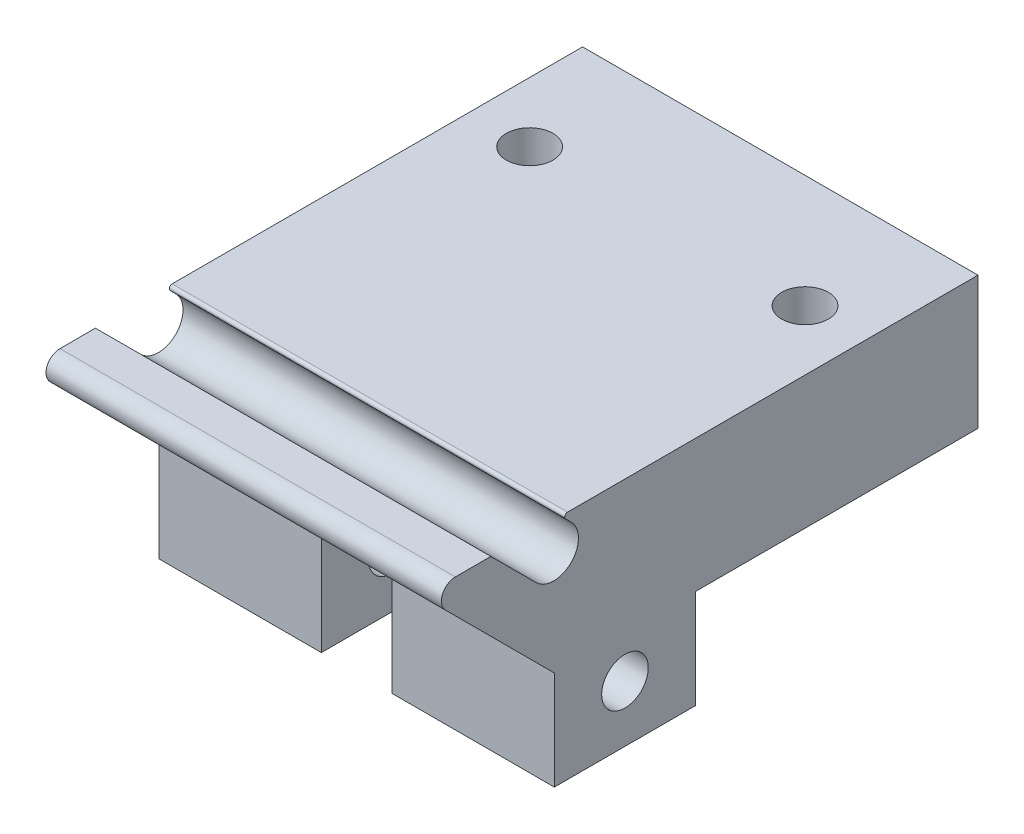
ISO-10303-21;
HEADER;
FILE_DESCRIPTION(('STEP AP214'),'2;1');
FILE_NAME('part.step','',(''),(''),'','','');
FILE_SCHEMA(('AUTOMOTIVE_DESIGN { 1 0 10303 214 1 1 1 1 }'));
ENDSEC;
DATA;
#1=APPLICATION_CONTEXT('core data for automotive mechanical design processes');
#2=APPLICATION_PROTOCOL_DEFINITION('international standard','automotive_design',2000,#1);
#3=PRODUCT_CONTEXT('',#1,'mechanical');
#4=PRODUCT('Part','Part','',(#3));
#5=PRODUCT_RELATED_PRODUCT_CATEGORY('part','',(#4));
#6=PRODUCT_DEFINITION_FORMATION('','',#4);
#7=PRODUCT_DEFINITION_CONTEXT('part definition',#1,'design');
#8=PRODUCT_DEFINITION('design','',#6,#7);
#9=PRODUCT_DEFINITION_SHAPE('','',#8);
#10=(LENGTH_UNIT() NAMED_UNIT(*) SI_UNIT(.MILLI.,.METRE.));
#11=(NAMED_UNIT(*) PLANE_ANGLE_UNIT() SI_UNIT($,.RADIAN.));
#12=(NAMED_UNIT(*) SI_UNIT($,.STERADIAN.) SOLID_ANGLE_UNIT());
#13=UNCERTAINTY_MEASURE_WITH_UNIT(LENGTH_MEASURE(1.E-05),#10,'distance_accuracy_value','');
#14=(GEOMETRIC_REPRESENTATION_CONTEXT(3) GLOBAL_UNCERTAINTY_ASSIGNED_CONTEXT((#13)) GLOBAL_UNIT_ASSIGNED_CONTEXT((#10,
#11,#12)) REPRESENTATION_CONTEXT('',''));
#15=CARTESIAN_POINT('',(0.,0.,0.));
#16=DIRECTION('',(0.,0.,1.));
#17=DIRECTION('',(1.,0.,0.));
#18=AXIS2_PLACEMENT_3D('',#15,#16,#17);
#19=CARTESIAN_POINT('',(-14.,3.7104647199012,37.0114647199012));
#20=DIRECTION('',(-1.,0.,0.));
#21=DIRECTION('',(0.,-1.,0.));
#22=AXIS2_PLACEMENT_3D('',#19,#20,#21);
#23=CYLINDRICAL_SURFACE('',#22,0.988535280098797);
#24=DIRECTION('',(1.,0.,0.));
#25=VECTOR('',#24,1.);
#26=CARTESIAN_POINT('',(-14.,4.699,37.0114647199012));
#27=LINE('',#26,#25);
#28=CARTESIAN_POINT('',(-14.,4.699,37.0114647199012));
#29=VERTEX_POINT('',#28);
#30=CARTESIAN_POINT('',(14.,4.699,37.0114647199012));
#31=VERTEX_POINT('',#30);
#32=EDGE_CURVE('E219',#29,#31,#27,.T.);
#33=ORIENTED_EDGE('',*,*,#32,.F.);
#34=CARTESIAN_POINT('',(-14.,3.7104647199012,37.0114647199012));
#35=DIRECTION('',(1.,0.,0.));
#36=DIRECTION('',(0.,0.,-1.));
#37=AXIS2_PLACEMENT_3D('',#34,#35,#36);
#38=CIRCLE('',#37,0.988535280098797);
#39=CARTESIAN_POINT('',(-14.,3.0114647199012,37.7104647199012));
#40=VERTEX_POINT('',#39);
#41=EDGE_CURVE('E50',#40,#29,#38,.F.);
#42=ORIENTED_EDGE('',*,*,#41,.F.);
#43=DIRECTION('',(-1.,0.,0.));
#44=VECTOR('',#43,1.);
#45=CARTESIAN_POINT('',(0.,3.0114647199012,37.7104647199012));
#46=LINE('',#45,#44);
#47=CARTESIAN_POINT('',(14.,3.0114647199012,37.7104647199012));
#48=VERTEX_POINT('',#47);
#49=EDGE_CURVE('E221',#48,#40,#46,.T.);
#50=ORIENTED_EDGE('',*,*,#49,.F.);
#51=CARTESIAN_POINT('',(14.,3.71046471990121,37.0114647199012));
#52=DIRECTION('',(-1.,0.,0.));
#53=DIRECTION('',(0.,-1.,0.));
#54=AXIS2_PLACEMENT_3D('',#51,#52,#53);
#55=CIRCLE('',#54,0.988535280098797);
#56=EDGE_CURVE('E12',#31,#48,#55,.F.);
#57=ORIENTED_EDGE('',*,*,#56,.F.);
#58=EDGE_LOOP('',(#33,#42,#50,#57));
#59=FACE_BOUND('',#58,.T.);
#60=ADVANCED_FACE('F42',(#59),#23,.T.);
#61=CARTESIAN_POINT('',(-14.,2.71910101267769,30.0452272785247));
#62=DIRECTION('',(-1.,0.,0.));
#63=DIRECTION('',(0.,0.,1.));
#64=AXIS2_PLACEMENT_3D('',#61,#62,#63);
#65=CYLINDRICAL_SURFACE('',#64,1.75);
#66=DIRECTION('',(1.,0.,0.));
#67=VECTOR('',#66,1.);
#68=CARTESIAN_POINT('',(-14.,3.95653787975415,28.8077904114483));
#69=LINE('',#68,#67);
#70=CARTESIAN_POINT('',(-14.,3.95653787975415,28.8077904114483));
#71=VERTEX_POINT('',#70);
#72=CARTESIAN_POINT('',(14.,3.95653787975415,28.8077904114483));
#73=VERTEX_POINT('',#72);
#74=EDGE_CURVE('E184',#71,#73,#69,.T.);
#75=ORIENTED_EDGE('',*,*,#74,.F.);
#76=CARTESIAN_POINT('',(-14.,2.71910101267769,30.0452272785247));
#77=DIRECTION('',(1.,0.,0.));
#78=DIRECTION('',(0.,0.,-1.));
#79=AXIS2_PLACEMENT_3D('',#76,#77,#78);
#80=CIRCLE('',#79,1.75);
#81=CARTESIAN_POINT('',(-14.,1.48166414560123,31.2826641456012));
#82=VERTEX_POINT('',#81);
#83=EDGE_CURVE('E197',#71,#82,#80,.F.);
#84=ORIENTED_EDGE('',*,*,#83,.T.);
#85=DIRECTION('',(1.,0.,0.));
#86=VECTOR('',#85,1.);
#87=CARTESIAN_POINT('',(-14.,1.48166414560122,31.2826641456012));
#88=LINE('',#87,#86);
#89=CARTESIAN_POINT('',(14.,1.48166414560122,31.2826641456012));
#90=VERTEX_POINT('',#89);
#91=EDGE_CURVE('E177',#90,#82,#88,.F.);
#92=ORIENTED_EDGE('',*,*,#91,.F.);
#93=CARTESIAN_POINT('',(14.,2.71910101267769,30.0452272785247));
#94=DIRECTION('',(-1.,0.,0.));
#95=DIRECTION('',(0.,-1.,0.));
#96=AXIS2_PLACEMENT_3D('',#93,#94,#95);
#97=CIRCLE('',#96,1.75);
#98=EDGE_CURVE('E199',#90,#73,#97,.F.);
#99=ORIENTED_EDGE('',*,*,#98,.T.);
#100=EDGE_LOOP('',(#75,#84,#92,#99));
#101=FACE_BOUND('',#100,.T.);
#102=ADVANCED_FACE('F381',(#101),#65,.F.);
#103=CARTESIAN_POINT('',(14.,4.699,30.));
#104=DIRECTION('',(0.,-1.,0.));
#105=DIRECTION('',(1.,0.,0.));
#106=AXIS2_PLACEMENT_3D('',#103,#104,#105);
#107=PLANE('',#106);
#108=DIRECTION('',(0.,0.,-1.));
#109=VECTOR('',#108,1.);
#110=CARTESIAN_POINT('',(-14.,4.699,30.));
#111=LINE('',#110,#109);
#112=CARTESIAN_POINT('',(-14.,4.699,34.5));
#113=VERTEX_POINT('',#112);
#114=EDGE_CURVE('E158',#29,#113,#111,.T.);
#115=ORIENTED_EDGE('',*,*,#114,.F.);
#116=ORIENTED_EDGE('',*,*,#32,.T.);
#117=DIRECTION('',(0.,0.,-1.));
#118=VECTOR('',#117,1.);
#119=CARTESIAN_POINT('',(14.,4.699,30.));
#120=LINE('',#119,#118);
#121=CARTESIAN_POINT('',(14.,4.699,34.5));
#122=VERTEX_POINT('',#121);
#123=EDGE_CURVE('E182',#31,#122,#120,.T.);
#124=ORIENTED_EDGE('',*,*,#123,.T.);
#125=DIRECTION('',(-1.,0.,0.));
#126=VECTOR('',#125,1.);
#127=CARTESIAN_POINT('',(14.,4.699,34.5));
#128=LINE('',#127,#126);
#129=EDGE_CURVE('E175',#122,#113,#128,.T.);
#130=ORIENTED_EDGE('',*,*,#129,.T.);
#131=EDGE_LOOP('',(#115,#116,#124,#130));
#132=FACE_BOUND('',#131,.T.);
#133=ADVANCED_FACE('F181',(#132),#107,.F.);
#134=CARTESIAN_POINT('',(0.,0.,30.));
#135=DIRECTION('',(0.,0.,-1.));
#136=DIRECTION('',(-1.,0.,0.));
#137=AXIS2_PLACEMENT_3D('',#134,#135,#136);
#138=PLANE('',#137);
#139=DIRECTION('',(1.,0.,0.));
#140=VECTOR('',#139,1.);
#141=CARTESIAN_POINT('',(-14.,-4.699,30.));
#142=LINE('',#141,#140);
#143=CARTESIAN_POINT('',(-14.,-4.699,30.));
#144=VERTEX_POINT('',#143);
#145=CARTESIAN_POINT('',(-2.5,-4.699,30.));
#146=VERTEX_POINT('',#145);
#147=EDGE_CURVE('E256',#144,#146,#142,.T.);
#148=ORIENTED_EDGE('',*,*,#147,.F.);
#149=DIRECTION('',(0.,-1.,0.));
#150=VECTOR('',#149,1.);
#151=CARTESIAN_POINT('',(-14.,4.699,30.));
#152=LINE('',#151,#150);
#153=CARTESIAN_POINT('',(-14.,-11.699,30.));
#154=VERTEX_POINT('',#153);
#155=EDGE_CURVE('E313',#144,#154,#152,.T.);
#156=ORIENTED_EDGE('',*,*,#155,.T.);
#157=DIRECTION('',(-1.,0.,0.));
#158=VECTOR('',#157,1.);
#159=CARTESIAN_POINT('',(-14.,-11.699,30.));
#160=LINE('',#159,#158);
#161=CARTESIAN_POINT('',(-2.5,-11.699,30.));
#162=VERTEX_POINT('',#161);
#163=EDGE_CURVE('E258',#162,#154,#160,.T.);
#164=ORIENTED_EDGE('',*,*,#163,.F.);
#165=DIRECTION('',(0.,1.,0.));
#166=VECTOR('',#165,1.);
#167=CARTESIAN_POINT('',(-2.5,-11.699,30.));
#168=LINE('',#167,#166);
#169=EDGE_CURVE('E247',#162,#146,#168,.T.);
#170=ORIENTED_EDGE('',*,*,#169,.T.);
#171=EDGE_LOOP('',(#148,#156,#164,#170));
#172=FACE_BOUND('',#171,.T.);
#173=ADVANCED_FACE('F255',(#172),#138,.F.);
#174=CARTESIAN_POINT('',(2.5,-4.699,30.));
#175=VERTEX_POINT('',#174);
#176=CARTESIAN_POINT('',(14.,-4.699,30.));
#177=VERTEX_POINT('',#176);
#178=EDGE_CURVE('E185',#175,#177,#142,.T.);
#179=ORIENTED_EDGE('',*,*,#178,.F.);
#180=DIRECTION('',(0.,1.,0.));
#181=VECTOR('',#180,1.);
#182=CARTESIAN_POINT('',(2.5,-11.699,30.));
#183=LINE('',#182,#181);
#184=CARTESIAN_POINT('',(2.5,-11.699,30.));
#185=VERTEX_POINT('',#184);
#186=EDGE_CURVE('E288',#185,#175,#183,.T.);
#187=ORIENTED_EDGE('',*,*,#186,.F.);
#188=DIRECTION('',(-1.,0.,0.));
#189=VECTOR('',#188,1.);
#190=CARTESIAN_POINT('',(2.5,-11.699,30.));
#191=LINE('',#190,#189);
#192=CARTESIAN_POINT('',(14.,-11.699,30.));
#193=VERTEX_POINT('',#192);
#194=EDGE_CURVE('E286',#193,#185,#191,.T.);
#195=ORIENTED_EDGE('',*,*,#194,.F.);
#196=DIRECTION('',(0.,1.,0.));
#197=VECTOR('',#196,1.);
#198=CARTESIAN_POINT('',(14.,4.699,30.));
#199=LINE('',#198,#197);
#200=EDGE_CURVE('E316',#193,#177,#199,.T.);
#201=ORIENTED_EDGE('',*,*,#200,.T.);
#202=EDGE_LOOP('',(#179,#187,#195,#201));
#203=FACE_BOUND('',#202,.T.);
#204=ADVANCED_FACE('F393',(#203),#138,.F.);
#205=CARTESIAN_POINT('',(14.,-4.699,30.));
#206=DIRECTION('',(0.,1.,0.));
#207=DIRECTION('',(-1.,0.,0.));
#208=AXIS2_PLACEMENT_3D('',#205,#206,#207);
#209=PLANE('',#208);
#210=CARTESIAN_POINT('',(9.75,-4.699,8.));
#211=DIRECTION('',(0.,-1.,0.));
#212=DIRECTION('',(0.,0.,-1.));
#213=AXIS2_PLACEMENT_3D('',#210,#211,#212);
#214=CIRCLE('',#213,1.65);
#215=CARTESIAN_POINT('',(9.75,-4.699,6.35));
#216=VERTEX_POINT('',#215);
#217=EDGE_CURVE('E346',#216,#216,#214,.T.);
#218=ORIENTED_EDGE('',*,*,#217,.F.);
#219=EDGE_LOOP('',(#218));
#220=FACE_BOUND('',#219,.T.);
#221=CARTESIAN_POINT('',(-9.75,-4.699,8.));
#222=DIRECTION('',(0.,-1.,0.));
#223=DIRECTION('',(0.,0.,-1.));
#224=AXIS2_PLACEMENT_3D('',#221,#222,#223);
#225=CIRCLE('',#224,1.65);
#226=CARTESIAN_POINT('',(-9.75,-4.699,6.35));
#227=VERTEX_POINT('',#226);
#228=EDGE_CURVE('E354',#227,#227,#225,.T.);
#229=ORIENTED_EDGE('',*,*,#228,.F.);
#230=EDGE_LOOP('',(#229));
#231=FACE_BOUND('',#230,.T.);
#232=DIRECTION('',(0.,0.,-1.));
#233=VECTOR('',#232,1.);
#234=CARTESIAN_POINT('',(2.5,-4.699,20.));
#235=LINE('',#234,#233);
#236=CARTESIAN_POINT('',(2.5,-4.699,20.));
#237=VERTEX_POINT('',#236);
#238=EDGE_CURVE('E239',#175,#237,#235,.T.);
#239=ORIENTED_EDGE('',*,*,#238,.F.);
#240=DIRECTION('',(-1.,0.,0.));
#241=VECTOR('',#240,1.);
#242=CARTESIAN_POINT('',(-14.,-4.699,30.));
#243=LINE('',#242,#241);
#244=EDGE_CURVE('E214',#175,#146,#243,.T.);
#245=ORIENTED_EDGE('',*,*,#244,.T.);
#246=DIRECTION('',(0.,0.,1.));
#247=VECTOR('',#246,1.);
#248=CARTESIAN_POINT('',(-2.5,-4.699,20.));
#249=LINE('',#248,#247);
#250=CARTESIAN_POINT('',(-2.5,-4.699,20.));
#251=VERTEX_POINT('',#250);
#252=EDGE_CURVE('E235',#251,#146,#249,.T.);
#253=ORIENTED_EDGE('',*,*,#252,.F.);
#254=DIRECTION('',(1.,0.,0.));
#255=VECTOR('',#254,1.);
#256=CARTESIAN_POINT('',(-14.,-4.699,20.));
#257=LINE('',#256,#255);
#258=CARTESIAN_POINT('',(-14.,-4.699,20.));
#259=VERTEX_POINT('',#258);
#260=EDGE_CURVE('E252',#259,#251,#257,.T.);
#261=ORIENTED_EDGE('',*,*,#260,.F.);
#262=DIRECTION('',(0.,0.,-1.));
#263=VECTOR('',#262,1.);
#264=CARTESIAN_POINT('',(-14.,-4.699,30.));
#265=LINE('',#264,#263);
#266=CARTESIAN_POINT('',(-14.,-4.699,0.));
#267=VERTEX_POINT('',#266);
#268=EDGE_CURVE('E190',#259,#267,#265,.T.);
#269=ORIENTED_EDGE('',*,*,#268,.T.);
#270=DIRECTION('',(1.,0.,0.));
#271=VECTOR('',#270,1.);
#272=CARTESIAN_POINT('',(14.,-4.699,0.));
#273=LINE('',#272,#271);
#274=CARTESIAN_POINT('',(14.,-4.699,0.));
#275=VERTEX_POINT('',#274);
#276=EDGE_CURVE('E328',#267,#275,#273,.T.);
#277=ORIENTED_EDGE('',*,*,#276,.T.);
#278=DIRECTION('',(0.,0.,-1.));
#279=VECTOR('',#278,1.);
#280=CARTESIAN_POINT('',(14.,-4.699,30.));
#281=LINE('',#280,#279);
#282=CARTESIAN_POINT('',(14.,-4.699,20.));
#283=VERTEX_POINT('',#282);
#284=EDGE_CURVE('E337',#283,#275,#281,.T.);
#285=ORIENTED_EDGE('',*,*,#284,.F.);
#286=DIRECTION('',(1.,0.,0.));
#287=VECTOR('',#286,1.);
#288=CARTESIAN_POINT('',(2.5,-4.699,20.));
#289=LINE('',#288,#287);
#290=EDGE_CURVE('E281',#237,#283,#289,.T.);
#291=ORIENTED_EDGE('',*,*,#290,.F.);
#292=EDGE_LOOP('',(#239,#245,#253,#261,#269,#277,#285,#291));
#293=FACE_BOUND('',#292,.T.);
#294=ADVANCED_FACE('F234',(#220,#231,#293),#209,.F.);
#295=CARTESIAN_POINT('',(-14.,4.699,30.));
#296=DIRECTION('',(1.,0.,0.));
#297=DIRECTION('',(0.,0.,-1.));
#298=AXIS2_PLACEMENT_3D('',#295,#296,#297);
#299=PLANE('',#298);
#300=CARTESIAN_POINT('',(-14.,-7.699,25.));
#301=DIRECTION('',(-1.,0.,0.));
#302=DIRECTION('',(0.,0.,1.));
#303=AXIS2_PLACEMENT_3D('',#300,#301,#302);
#304=CIRCLE('',#303,1.64999999999999);
#305=CARTESIAN_POINT('',(-14.,-7.699,26.65));
#306=VERTEX_POINT('',#305);
#307=EDGE_CURVE('E261',#306,#306,#304,.T.);
#308=ORIENTED_EDGE('',*,*,#307,.F.);
#309=EDGE_LOOP('',(#308));
#310=FACE_BOUND('',#309,.T.);
#311=DIRECTION('',(0.,0.707106781186546,0.707106781186549));
#312=VECTOR('',#311,1.);
#313=CARTESIAN_POINT('',(-14.,3.30099999999999,38.));
#314=LINE('',#313,#312);
#315=EDGE_CURVE('E225',#144,#40,#314,.T.);
#316=ORIENTED_EDGE('',*,*,#315,.T.);
#317=ORIENTED_EDGE('',*,*,#41,.T.);
#318=ORIENTED_EDGE('',*,*,#114,.T.);
#319=DIRECTION('',(0.,0.707106781186544,0.707106781186551));
#320=VECTOR('',#319,1.);
#321=CARTESIAN_POINT('',(-14.,4.699,34.5));
#322=LINE('',#321,#320);
#323=EDGE_CURVE('E163',#82,#113,#322,.T.);
#324=ORIENTED_EDGE('',*,*,#323,.F.);
#325=ORIENTED_EDGE('',*,*,#83,.F.);
#326=DIRECTION('',(0.,-0.707106781186544,-0.707106781186551));
#327=VECTOR('',#326,1.);
#328=CARTESIAN_POINT('',(-14.,2.7191010126777,27.5703535443718));
#329=LINE('',#328,#327);
#330=CARTESIAN_POINT('',(-14.,4.35757864376269,29.2088311754568));
#331=VERTEX_POINT('',#330);
#332=EDGE_CURVE('E179',#331,#71,#329,.T.);
#333=ORIENTED_EDGE('',*,*,#332,.F.);
#334=CARTESIAN_POINT('',(-14.,4.499,29.0674098192195));
#335=DIRECTION('',(1.,0.,0.));
#336=DIRECTION('',(0.,0.,-1.));
#337=AXIS2_PLACEMENT_3D('',#334,#335,#336);
#338=CIRCLE('',#337,0.2);
#339=CARTESIAN_POINT('',(-14.,4.699,29.0674098192195));
#340=VERTEX_POINT('',#339);
#341=EDGE_CURVE('E209',#331,#340,#338,.F.);
#342=ORIENTED_EDGE('',*,*,#341,.T.);
#343=CARTESIAN_POINT('',(-14.,4.699,0.));
#344=VERTEX_POINT('',#343);
#345=EDGE_CURVE('E168',#340,#344,#111,.T.);
#346=ORIENTED_EDGE('',*,*,#345,.T.);
#347=DIRECTION('',(0.,-1.,0.));
#348=VECTOR('',#347,1.);
#349=CARTESIAN_POINT('',(-14.,4.699,0.));
#350=LINE('',#349,#348);
#351=EDGE_CURVE('E325',#344,#267,#350,.T.);
#352=ORIENTED_EDGE('',*,*,#351,.T.);
#353=ORIENTED_EDGE('',*,*,#268,.F.);
#354=DIRECTION('',(0.,1.,0.));
#355=VECTOR('',#354,1.);
#356=CARTESIAN_POINT('',(-14.,-11.699,20.));
#357=LINE('',#356,#355);
#358=CARTESIAN_POINT('',(-14.,-11.699,20.));
#359=VERTEX_POINT('',#358);
#360=EDGE_CURVE('E344',#359,#259,#357,.T.);
#361=ORIENTED_EDGE('',*,*,#360,.F.);
#362=DIRECTION('',(0.,0.,-1.));
#363=VECTOR('',#362,1.);
#364=CARTESIAN_POINT('',(-14.,-11.699,20.));
#365=LINE('',#364,#363);
#366=EDGE_CURVE('E251',#154,#359,#365,.T.);
#367=ORIENTED_EDGE('',*,*,#366,.F.);
#368=ORIENTED_EDGE('',*,*,#155,.F.);
#369=EDGE_LOOP('',(#316,#317,#318,#324,#325,#333,#342,#346,#352,#353,#361,#367,#368));
#370=FACE_BOUND('',#369,.T.);
#371=ADVANCED_FACE('F161',(#310,#370),#299,.F.);
#372=CARTESIAN_POINT('',(14.,4.699,30.));
#373=DIRECTION('',(-1.,0.,0.));
#374=DIRECTION('',(0.,-1.,0.));
#375=AXIS2_PLACEMENT_3D('',#372,#373,#374);
#376=PLANE('',#375);
#377=ORIENTED_EDGE('',*,*,#123,.F.);
#378=ORIENTED_EDGE('',*,*,#56,.T.);
#379=DIRECTION('',(0.,-0.707106781186546,-0.707106781186549));
#380=VECTOR('',#379,1.);
#381=CARTESIAN_POINT('',(14.,3.301,38.));
#382=LINE('',#381,#380);
#383=EDGE_CURVE('E211',#48,#177,#382,.T.);
#384=ORIENTED_EDGE('',*,*,#383,.T.);
#385=ORIENTED_EDGE('',*,*,#200,.F.);
#386=DIRECTION('',(0.,0.,1.));
#387=VECTOR('',#386,1.);
#388=CARTESIAN_POINT('',(14.,-11.699,20.));
#389=LINE('',#388,#387);
#390=CARTESIAN_POINT('',(14.,-11.699,20.));
#391=VERTEX_POINT('',#390);
#392=EDGE_CURVE('E283',#391,#193,#389,.T.);
#393=ORIENTED_EDGE('',*,*,#392,.F.);
#394=DIRECTION('',(0.,1.,0.));
#395=VECTOR('',#394,1.);
#396=CARTESIAN_POINT('',(14.,-11.699,20.));
#397=LINE('',#396,#395);
#398=EDGE_CURVE('E290',#391,#283,#397,.T.);
#399=ORIENTED_EDGE('',*,*,#398,.T.);
#400=ORIENTED_EDGE('',*,*,#284,.T.);
#401=DIRECTION('',(0.,1.,0.));
#402=VECTOR('',#401,1.);
#403=CARTESIAN_POINT('',(14.,4.699,0.));
#404=LINE('',#403,#402);
#405=CARTESIAN_POINT('',(14.,4.699,0.));
#406=VERTEX_POINT('',#405);
#407=EDGE_CURVE('E331',#275,#406,#404,.T.);
#408=ORIENTED_EDGE('',*,*,#407,.T.);
#409=CARTESIAN_POINT('',(14.,4.699,29.0674098192195));
#410=VERTEX_POINT('',#409);
#411=EDGE_CURVE('E167',#410,#406,#120,.T.);
#412=ORIENTED_EDGE('',*,*,#411,.F.);
#413=CARTESIAN_POINT('',(14.,4.499,29.0674098192195));
#414=DIRECTION('',(-1.,0.,0.));
#415=DIRECTION('',(0.,-1.,0.));
#416=AXIS2_PLACEMENT_3D('',#413,#414,#415);
#417=CIRCLE('',#416,0.2);
#418=CARTESIAN_POINT('',(14.,4.35757864376269,29.2088311754568));
#419=VERTEX_POINT('',#418);
#420=EDGE_CURVE('E205',#410,#419,#417,.F.);
#421=ORIENTED_EDGE('',*,*,#420,.T.);
#422=DIRECTION('',(0.,-0.707106781186544,-0.707106781186551));
#423=VECTOR('',#422,1.);
#424=CARTESIAN_POINT('',(14.,4.92387373415293,29.7751262658471));
#425=LINE('',#424,#423);
#426=EDGE_CURVE('E178',#419,#73,#425,.T.);
#427=ORIENTED_EDGE('',*,*,#426,.T.);
#428=ORIENTED_EDGE('',*,*,#98,.F.);
#429=DIRECTION('',(0.,0.707106781186544,0.707106781186551));
#430=VECTOR('',#429,1.);
#431=CARTESIAN_POINT('',(14.,2.449,32.25));
#432=LINE('',#431,#430);
#433=EDGE_CURVE('E262',#90,#122,#432,.T.);
#434=ORIENTED_EDGE('',*,*,#433,.T.);
#435=EDGE_LOOP('',(#377,#378,#384,#385,#393,#399,#400,#408,#412,#421,#427,#428,#434));
#436=FACE_BOUND('',#435,.T.);
#437=CARTESIAN_POINT('',(14.,-7.699,25.));
#438=DIRECTION('',(-1.,0.,0.));
#439=DIRECTION('',(0.,0.,1.));
#440=AXIS2_PLACEMENT_3D('',#437,#438,#439);
#441=CIRCLE('',#440,1.65);
#442=CARTESIAN_POINT('',(14.,-7.699,26.65));
#443=VERTEX_POINT('',#442);
#444=EDGE_CURVE('E265',#443,#443,#441,.T.);
#445=ORIENTED_EDGE('',*,*,#444,.T.);
#446=EDGE_LOOP('',(#445));
#447=FACE_BOUND('',#446,.T.);
#448=ADVANCED_FACE('F388',(#436,#447),#376,.F.);
#449=CARTESIAN_POINT('',(9.75,4.69900000000001,8.));
#450=DIRECTION('',(0.,-1.,0.));
#451=DIRECTION('',(0.,0.,-1.));
#452=AXIS2_PLACEMENT_3D('',#449,#450,#451);
#453=CIRCLE('',#452,1.65);
#454=CARTESIAN_POINT('',(9.75,4.69900000000001,6.35));
#455=VERTEX_POINT('',#454);
#456=EDGE_CURVE('E350',#455,#455,#453,.T.);
#457=ORIENTED_EDGE('',*,*,#456,.T.);
#458=EDGE_LOOP('',(#457));
#459=FACE_BOUND('',#458,.T.);
#460=CARTESIAN_POINT('',(-9.75,4.699,8.));
#461=DIRECTION('',(0.,-1.,0.));
#462=DIRECTION('',(0.,0.,-1.));
#463=AXIS2_PLACEMENT_3D('',#460,#461,#462);
#464=CIRCLE('',#463,1.65);
#465=CARTESIAN_POINT('',(-9.75,4.699,6.35));
#466=VERTEX_POINT('',#465);
#467=EDGE_CURVE('E321',#466,#466,#464,.T.);
#468=ORIENTED_EDGE('',*,*,#467,.T.);
#469=EDGE_LOOP('',(#468));
#470=FACE_BOUND('',#469,.T.);
#471=ORIENTED_EDGE('',*,*,#345,.F.);
#472=DIRECTION('',(1.,0.,0.));
#473=VECTOR('',#472,1.);
#474=CARTESIAN_POINT('',(14.,4.699,29.0674098192195));
#475=LINE('',#474,#473);
#476=EDGE_CURVE('E202',#340,#410,#475,.T.);
#477=ORIENTED_EDGE('',*,*,#476,.T.);
#478=ORIENTED_EDGE('',*,*,#411,.T.);
#479=DIRECTION('',(-1.,0.,0.));
#480=VECTOR('',#479,1.);
#481=CARTESIAN_POINT('',(14.,4.699,0.));
#482=LINE('',#481,#480);
#483=EDGE_CURVE('E317',#406,#344,#482,.T.);
#484=ORIENTED_EDGE('',*,*,#483,.T.);
#485=EDGE_LOOP('',(#471,#477,#478,#484));
#486=FACE_BOUND('',#485,.T.);
#487=ADVANCED_FACE('F362',(#459,#470,#486),#107,.F.);
#488=CARTESIAN_POINT('',(0.,0.,0.));
#489=DIRECTION('',(0.,0.,-1.));
#490=DIRECTION('',(-1.,0.,0.));
#491=AXIS2_PLACEMENT_3D('',#488,#489,#490);
#492=PLANE('',#491);
#493=ORIENTED_EDGE('',*,*,#351,.F.);
#494=ORIENTED_EDGE('',*,*,#483,.F.);
#495=ORIENTED_EDGE('',*,*,#407,.F.);
#496=ORIENTED_EDGE('',*,*,#276,.F.);
#497=EDGE_LOOP('',(#493,#494,#495,#496));
#498=FACE_BOUND('',#497,.T.);
#499=ADVANCED_FACE('F368',(#498),#492,.T.);
#500=CARTESIAN_POINT('',(-9.75,-4.699,8.));
#501=DIRECTION('',(0.,-1.,0.));
#502=DIRECTION('',(0.,0.,-1.));
#503=AXIS2_PLACEMENT_3D('',#500,#501,#502);
#504=CYLINDRICAL_SURFACE('',#503,1.65);
#505=ORIENTED_EDGE('',*,*,#467,.F.);
#506=EDGE_LOOP('',(#505));
#507=FACE_BOUND('',#506,.T.);
#508=ORIENTED_EDGE('',*,*,#228,.T.);
#509=EDGE_LOOP('',(#508));
#510=FACE_BOUND('',#509,.T.);
#511=ADVANCED_FACE('F365',(#507,#510),#504,.F.);
#512=CARTESIAN_POINT('',(9.75,-4.699,8.));
#513=DIRECTION('',(0.,-1.,0.));
#514=DIRECTION('',(0.,0.,-1.));
#515=AXIS2_PLACEMENT_3D('',#512,#513,#514);
#516=CYLINDRICAL_SURFACE('',#515,1.65);
#517=ORIENTED_EDGE('',*,*,#456,.F.);
#518=EDGE_LOOP('',(#517));
#519=FACE_BOUND('',#518,.T.);
#520=ORIENTED_EDGE('',*,*,#217,.T.);
#521=EDGE_LOOP('',(#520));
#522=FACE_BOUND('',#521,.T.);
#523=ADVANCED_FACE('F367',(#519,#522),#516,.F.);
#524=CARTESIAN_POINT('',(-14.,-11.699,20.));
#525=DIRECTION('',(0.,0.,1.));
#526=DIRECTION('',(1.,0.,0.));
#527=AXIS2_PLACEMENT_3D('',#524,#525,#526);
#528=PLANE('',#527);
#529=ORIENTED_EDGE('',*,*,#260,.T.);
#530=DIRECTION('',(0.,1.,0.));
#531=VECTOR('',#530,1.);
#532=CARTESIAN_POINT('',(-2.5,-11.699,20.));
#533=LINE('',#532,#531);
#534=CARTESIAN_POINT('',(-2.5,-11.699,20.));
#535=VERTEX_POINT('',#534);
#536=EDGE_CURVE('E250',#535,#251,#533,.T.);
#537=ORIENTED_EDGE('',*,*,#536,.F.);
#538=DIRECTION('',(1.,0.,0.));
#539=VECTOR('',#538,1.);
#540=CARTESIAN_POINT('',(-14.,-11.699,20.));
#541=LINE('',#540,#539);
#542=EDGE_CURVE('E297',#359,#535,#541,.T.);
#543=ORIENTED_EDGE('',*,*,#542,.F.);
#544=ORIENTED_EDGE('',*,*,#360,.T.);
#545=EDGE_LOOP('',(#529,#537,#543,#544));
#546=FACE_BOUND('',#545,.T.);
#547=ADVANCED_FACE('F374',(#546),#528,.F.);
#548=CARTESIAN_POINT('',(-2.5,-11.699,20.));
#549=DIRECTION('',(-1.,0.,0.));
#550=DIRECTION('',(0.,-1.,0.));
#551=AXIS2_PLACEMENT_3D('',#548,#549,#550);
#552=PLANE('',#551);
#553=CARTESIAN_POINT('',(-2.5,-7.699,25.));
#554=DIRECTION('',(-1.,0.,0.));
#555=DIRECTION('',(0.,-1.,0.));
#556=AXIS2_PLACEMENT_3D('',#553,#554,#555);
#557=CIRCLE('',#556,1.64999999999999);
#558=CARTESIAN_POINT('',(-2.5,-9.34899999999999,25.));
#559=VERTEX_POINT('',#558);
#560=EDGE_CURVE('E274',#559,#559,#557,.T.);
#561=ORIENTED_EDGE('',*,*,#560,.T.);
#562=EDGE_LOOP('',(#561));
#563=FACE_BOUND('',#562,.T.);
#564=ORIENTED_EDGE('',*,*,#252,.T.);
#565=ORIENTED_EDGE('',*,*,#169,.F.);
#566=DIRECTION('',(0.,0.,1.));
#567=VECTOR('',#566,1.);
#568=CARTESIAN_POINT('',(-2.5,-11.699,20.));
#569=LINE('',#568,#567);
#570=EDGE_CURVE('E299',#535,#162,#569,.T.);
#571=ORIENTED_EDGE('',*,*,#570,.F.);
#572=ORIENTED_EDGE('',*,*,#536,.T.);
#573=EDGE_LOOP('',(#564,#565,#571,#572));
#574=FACE_BOUND('',#573,.T.);
#575=ADVANCED_FACE('F245',(#563,#574),#552,.F.);
#576=CARTESIAN_POINT('',(0.,-11.699,0.));
#577=DIRECTION('',(0.,1.,0.));
#578=DIRECTION('',(-1.,0.,0.));
#579=AXIS2_PLACEMENT_3D('',#576,#577,#578);
#580=PLANE('',#579);
#581=ORIENTED_EDGE('',*,*,#366,.T.);
#582=ORIENTED_EDGE('',*,*,#542,.T.);
#583=ORIENTED_EDGE('',*,*,#570,.T.);
#584=ORIENTED_EDGE('',*,*,#163,.T.);
#585=EDGE_LOOP('',(#581,#582,#583,#584));
#586=FACE_BOUND('',#585,.T.);
#587=ADVANCED_FACE('F409',(#586),#580,.F.);
#588=CARTESIAN_POINT('',(2.5,-11.699,20.));
#589=DIRECTION('',(1.,0.,0.));
#590=DIRECTION('',(0.,1.,0.));
#591=AXIS2_PLACEMENT_3D('',#588,#589,#590);
#592=PLANE('',#591);
#593=CARTESIAN_POINT('',(2.5,-7.699,25.));
#594=DIRECTION('',(1.,0.,0.));
#595=DIRECTION('',(0.,1.,0.));
#596=AXIS2_PLACEMENT_3D('',#593,#594,#595);
#597=CIRCLE('',#596,1.64999999999999);
#598=CARTESIAN_POINT('',(2.5,-6.04900000000001,25.));
#599=VERTEX_POINT('',#598);
#600=EDGE_CURVE('E273',#599,#599,#597,.T.);
#601=ORIENTED_EDGE('',*,*,#600,.T.);
#602=EDGE_LOOP('',(#601));
#603=FACE_BOUND('',#602,.T.);
#604=ORIENTED_EDGE('',*,*,#238,.T.);
#605=DIRECTION('',(0.,1.,0.));
#606=VECTOR('',#605,1.);
#607=CARTESIAN_POINT('',(2.5,-11.699,20.));
#608=LINE('',#607,#606);
#609=CARTESIAN_POINT('',(2.5,-11.699,20.));
#610=VERTEX_POINT('',#609);
#611=EDGE_CURVE('E293',#610,#237,#608,.T.);
#612=ORIENTED_EDGE('',*,*,#611,.F.);
#613=DIRECTION('',(0.,0.,-1.));
#614=VECTOR('',#613,1.);
#615=CARTESIAN_POINT('',(2.5,-11.699,20.));
#616=LINE('',#615,#614);
#617=EDGE_CURVE('E277',#185,#610,#616,.T.);
#618=ORIENTED_EDGE('',*,*,#617,.F.);
#619=ORIENTED_EDGE('',*,*,#186,.T.);
#620=EDGE_LOOP('',(#604,#612,#618,#619));
#621=FACE_BOUND('',#620,.T.);
#622=ADVANCED_FACE('F420',(#603,#621),#592,.F.);
#623=CARTESIAN_POINT('',(2.5,-11.699,20.));
#624=DIRECTION('',(0.,0.,1.));
#625=DIRECTION('',(1.,0.,0.));
#626=AXIS2_PLACEMENT_3D('',#623,#624,#625);
#627=PLANE('',#626);
#628=ORIENTED_EDGE('',*,*,#290,.T.);
#629=ORIENTED_EDGE('',*,*,#398,.F.);
#630=DIRECTION('',(1.,0.,0.));
#631=VECTOR('',#630,1.);
#632=CARTESIAN_POINT('',(2.5,-11.699,20.));
#633=LINE('',#632,#631);
#634=EDGE_CURVE('E280',#610,#391,#633,.T.);
#635=ORIENTED_EDGE('',*,*,#634,.F.);
#636=ORIENTED_EDGE('',*,*,#611,.T.);
#637=EDGE_LOOP('',(#628,#629,#635,#636));
#638=FACE_BOUND('',#637,.T.);
#639=ADVANCED_FACE('F423',(#638),#627,.F.);
#640=CARTESIAN_POINT('',(0.,-11.699,0.));
#641=DIRECTION('',(0.,1.,0.));
#642=DIRECTION('',(-1.,0.,0.));
#643=AXIS2_PLACEMENT_3D('',#640,#641,#642);
#644=PLANE('',#643);
#645=ORIENTED_EDGE('',*,*,#617,.T.);
#646=ORIENTED_EDGE('',*,*,#634,.T.);
#647=ORIENTED_EDGE('',*,*,#392,.T.);
#648=ORIENTED_EDGE('',*,*,#194,.T.);
#649=EDGE_LOOP('',(#645,#646,#647,#648));
#650=FACE_BOUND('',#649,.T.);
#651=ADVANCED_FACE('F427',(#650),#644,.F.);
#652=CARTESIAN_POINT('',(-14.,-7.699,25.));
#653=DIRECTION('',(-1.,0.,0.));
#654=DIRECTION('',(0.,0.,1.));
#655=AXIS2_PLACEMENT_3D('',#652,#653,#654);
#656=CYLINDRICAL_SURFACE('',#655,1.64999999999999);
#657=ORIENTED_EDGE('',*,*,#444,.F.);
#658=EDGE_LOOP('',(#657));
#659=FACE_BOUND('',#658,.T.);
#660=ORIENTED_EDGE('',*,*,#600,.F.);
#661=EDGE_LOOP('',(#660));
#662=FACE_BOUND('',#661,.T.);
#663=ADVANCED_FACE('F431',(#659,#662),#656,.F.);
#664=ORIENTED_EDGE('',*,*,#307,.T.);
#665=EDGE_LOOP('',(#664));
#666=FACE_BOUND('',#665,.T.);
#667=ORIENTED_EDGE('',*,*,#560,.F.);
#668=EDGE_LOOP('',(#667));
#669=FACE_BOUND('',#668,.T.);
#670=ADVANCED_FACE('F433',(#666,#669),#656,.F.);
#671=CARTESIAN_POINT('',(14.00005,4.699,34.5));
#672=DIRECTION('',(0.,-0.707106781186551,0.707106781186544));
#673=DIRECTION('',(0.,-0.707106781186544,-0.707106781186551));
#674=AXIS2_PLACEMENT_3D('',#671,#672,#673);
#675=PLANE('',#674);
#676=ORIENTED_EDGE('',*,*,#433,.F.);
#677=ORIENTED_EDGE('',*,*,#91,.T.);
#678=ORIENTED_EDGE('',*,*,#323,.T.);
#679=ORIENTED_EDGE('',*,*,#129,.F.);
#680=EDGE_LOOP('',(#676,#677,#678,#679));
#681=FACE_BOUND('',#680,.T.);
#682=ADVANCED_FACE('F174',(#681),#675,.F.);
#683=CARTESIAN_POINT('',(14.00005,2.7191010126777,27.5703535443718));
#684=DIRECTION('',(0.,0.707106781186551,-0.707106781186544));
#685=DIRECTION('',(0.,0.707106781186544,0.707106781186551));
#686=AXIS2_PLACEMENT_3D('',#683,#684,#685);
#687=PLANE('',#686);
#688=ORIENTED_EDGE('',*,*,#426,.F.);
#689=DIRECTION('',(1.,0.,0.));
#690=VECTOR('',#689,1.);
#691=CARTESIAN_POINT('',(14.00005,4.35757864376269,29.2088311754568));
#692=LINE('',#691,#690);
#693=EDGE_CURVE('E207',#419,#331,#692,.F.);
#694=ORIENTED_EDGE('',*,*,#693,.T.);
#695=ORIENTED_EDGE('',*,*,#332,.T.);
#696=ORIENTED_EDGE('',*,*,#74,.T.);
#697=EDGE_LOOP('',(#688,#694,#695,#696));
#698=FACE_BOUND('',#697,.T.);
#699=ADVANCED_FACE('F437',(#698),#687,.F.);
#700=CARTESIAN_POINT('',(14.,4.499,29.0674098192195));
#701=DIRECTION('',(1.,0.,0.));
#702=DIRECTION('',(0.,0.,-1.));
#703=AXIS2_PLACEMENT_3D('',#700,#701,#702);
#704=CYLINDRICAL_SURFACE('',#703,0.2);
#705=ORIENTED_EDGE('',*,*,#341,.F.);
#706=ORIENTED_EDGE('',*,*,#693,.F.);
#707=ORIENTED_EDGE('',*,*,#420,.F.);
#708=ORIENTED_EDGE('',*,*,#476,.F.);
#709=EDGE_LOOP('',(#705,#706,#707,#708));
#710=FACE_BOUND('',#709,.T.);
#711=ADVANCED_FACE('F440',(#710),#704,.T.);
#712=CARTESIAN_POINT('',(0.,3.30099999999999,38.));
#713=DIRECTION('',(0.,-0.707106781186549,0.707106781186546));
#714=DIRECTION('',(-1.,0.,0.));
#715=AXIS2_PLACEMENT_3D('',#712,#713,#714);
#716=PLANE('',#715);
#717=ORIENTED_EDGE('',*,*,#383,.F.);
#718=ORIENTED_EDGE('',*,*,#49,.T.);
#719=ORIENTED_EDGE('',*,*,#315,.F.);
#720=ORIENTED_EDGE('',*,*,#147,.T.);
#721=ORIENTED_EDGE('',*,*,#244,.F.);
#722=ORIENTED_EDGE('',*,*,#178,.T.);
#723=EDGE_LOOP('',(#717,#718,#719,#720,#721,#722));
#724=FACE_BOUND('',#723,.T.);
#725=ADVANCED_FACE('F260',(#724),#716,.T.);
#726=CLOSED_SHELL('',(#60,#102,#133,#173,#204,#294,#371,#448,#487,#499,#511,#523,#547,#575,#587,
#622,#639,#651,#663,#670,#682,#699,#711,#725));
#727=MANIFOLD_SOLID_BREP('B2',#726);
#728=ADVANCED_BREP_SHAPE_REPRESENTATION('',(#18,#727),#14);
#729=SHAPE_DEFINITION_REPRESENTATION(#9,#728);
ENDSEC;
END-ISO-10303-21;
